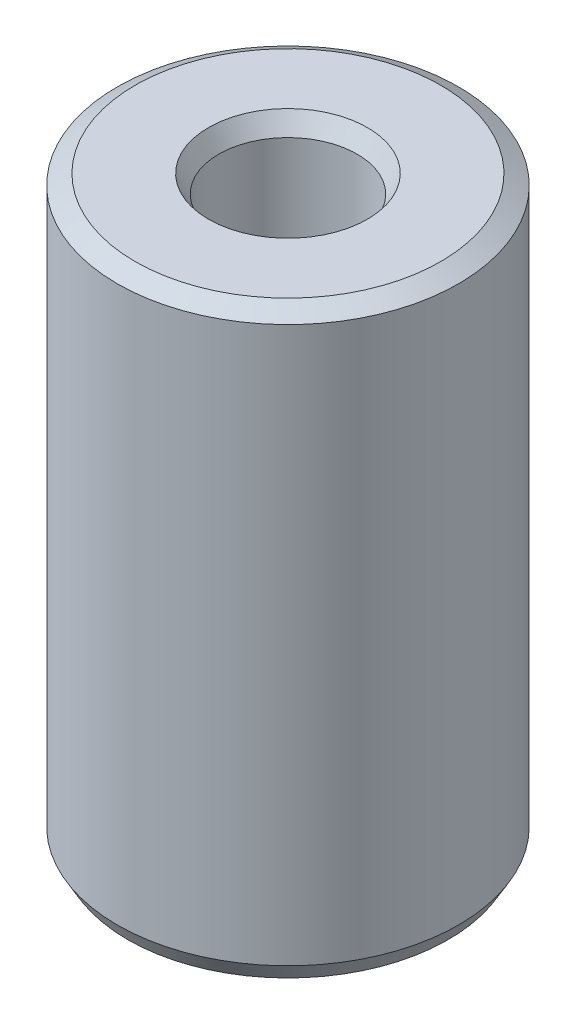
ISO-10303-21;
HEADER;
FILE_DESCRIPTION(('STEP AP214'),'2;1');
FILE_NAME('part.step','',(''),(''),'','','');
FILE_SCHEMA(('AUTOMOTIVE_DESIGN { 1 0 10303 214 1 1 1 1 }'));
ENDSEC;
DATA;
#1=APPLICATION_CONTEXT('core data for automotive mechanical design processes');
#2=APPLICATION_PROTOCOL_DEFINITION('international standard','automotive_design',2000,#1);
#3=PRODUCT_CONTEXT('',#1,'mechanical');
#4=PRODUCT('Part','Part','',(#3));
#5=PRODUCT_RELATED_PRODUCT_CATEGORY('part','',(#4));
#6=PRODUCT_DEFINITION_FORMATION('','',#4);
#7=PRODUCT_DEFINITION_CONTEXT('part definition',#1,'design');
#8=PRODUCT_DEFINITION('design','',#6,#7);
#9=PRODUCT_DEFINITION_SHAPE('','',#8);
#10=(LENGTH_UNIT() NAMED_UNIT(*) SI_UNIT(.MILLI.,.METRE.));
#11=(NAMED_UNIT(*) PLANE_ANGLE_UNIT() SI_UNIT($,.RADIAN.));
#12=(NAMED_UNIT(*) SI_UNIT($,.STERADIAN.) SOLID_ANGLE_UNIT());
#13=UNCERTAINTY_MEASURE_WITH_UNIT(LENGTH_MEASURE(1.E-05),#10,'distance_accuracy_value','');
#14=(GEOMETRIC_REPRESENTATION_CONTEXT(3) GLOBAL_UNCERTAINTY_ASSIGNED_CONTEXT((#13)) GLOBAL_UNIT_ASSIGNED_CONTEXT((#10,
#11,#12)) REPRESENTATION_CONTEXT('',''));
#15=CARTESIAN_POINT('',(0.,0.,0.));
#16=DIRECTION('',(0.,0.,1.));
#17=DIRECTION('',(1.,0.,0.));
#18=AXIS2_PLACEMENT_3D('',#15,#16,#17);
#19=CARTESIAN_POINT('',(0.,94.040246843153,0.));
#20=DIRECTION('',(0.,-1.,0.));
#21=DIRECTION('',(0.,0.,-1.));
#22=AXIS2_PLACEMENT_3D('',#19,#20,#21);
#23=CYLINDRICAL_SURFACE('',#22,27.5);
#24=CARTESIAN_POINT('',(0.,2.87658092964263,0.));
#25=DIRECTION('',(0.,1.,0.));
#26=DIRECTION('',(0.,0.,1.));
#27=AXIS2_PLACEMENT_3D('',#24,#25,#26);
#28=CIRCLE('',#27,27.5);
#29=CARTESIAN_POINT('',(0.,2.87658092964263,27.5));
#30=VERTEX_POINT('',#29);
#31=EDGE_CURVE('E10',#30,#30,#28,.T.);
#32=ORIENTED_EDGE('',*,*,#31,.T.);
#33=EDGE_LOOP('',(#32));
#34=FACE_BOUND('',#33,.T.);
#35=CARTESIAN_POINT('',(0.,92.3794520690781,0.));
#36=DIRECTION('',(0.,1.,0.));
#37=DIRECTION('',(0.,0.,1.));
#38=AXIS2_PLACEMENT_3D('',#35,#36,#37);
#39=CIRCLE('',#38,27.5);
#40=CARTESIAN_POINT('',(0.,92.3794520690781,27.5));
#41=VERTEX_POINT('',#40);
#42=EDGE_CURVE('E50',#41,#41,#39,.F.);
#43=ORIENTED_EDGE('',*,*,#42,.T.);
#44=EDGE_LOOP('',(#43));
#45=FACE_BOUND('',#44,.T.);
#46=ADVANCED_FACE('F39',(#34,#45),#23,.T.);
#47=CARTESIAN_POINT('',(0.,94.040246843153,0.));
#48=DIRECTION('',(0.,1.,0.));
#49=DIRECTION('',(0.,0.,1.));
#50=AXIS2_PLACEMENT_3D('',#47,#48,#49);
#51=PLANE('',#50);
#52=CARTESIAN_POINT('',(0.,94.040246843153,0.));
#53=DIRECTION('',(0.,1.,0.));
#54=DIRECTION('',(0.,0.,1.));
#55=AXIS2_PLACEMENT_3D('',#52,#53,#54);
#56=CIRCLE('',#55,12.8059751251069);
#57=CARTESIAN_POINT('',(0.,94.040246843153,12.8059751251069));
#58=VERTEX_POINT('',#57);
#59=EDGE_CURVE('E58',#58,#58,#56,.F.);
#60=ORIENTED_EDGE('',*,*,#59,.T.);
#61=EDGE_LOOP('',(#60));
#62=FACE_BOUND('',#61,.T.);
#63=CARTESIAN_POINT('',(0.,94.040246843153,0.));
#64=DIRECTION('',(0.,1.,0.));
#65=DIRECTION('',(0.,0.,1.));
#66=AXIS2_PLACEMENT_3D('',#63,#64,#65);
#67=CIRCLE('',#66,24.6234190703574);
#68=CARTESIAN_POINT('',(0.,94.040246843153,24.6234190703574));
#69=VERTEX_POINT('',#68);
#70=EDGE_CURVE('E61',#69,#69,#67,.T.);
#71=ORIENTED_EDGE('',*,*,#70,.T.);
#72=EDGE_LOOP('',(#71));
#73=FACE_BOUND('',#72,.T.);
#74=ADVANCED_FACE('F88',(#62,#73),#51,.T.);
#75=CARTESIAN_POINT('',(0.,0.,0.));
#76=DIRECTION('',(0.,1.,0.));
#77=DIRECTION('',(0.,0.,1.));
#78=AXIS2_PLACEMENT_3D('',#75,#76,#77);
#79=PLANE('',#78);
#80=CARTESIAN_POINT('',(0.,0.,0.));
#81=DIRECTION('',(0.,1.,0.));
#82=DIRECTION('',(0.,0.,1.));
#83=AXIS2_PLACEMENT_3D('',#80,#81,#82);
#84=CIRCLE('',#83,14.0217612806746);
#85=CARTESIAN_POINT('',(0.,0.,14.0217612806746));
#86=VERTEX_POINT('',#85);
#87=EDGE_CURVE('E51',#86,#86,#84,.T.);
#88=ORIENTED_EDGE('',*,*,#87,.T.);
#89=EDGE_LOOP('',(#88));
#90=FACE_BOUND('',#89,.T.);
#91=CARTESIAN_POINT('',(0.,0.,0.));
#92=DIRECTION('',(0.,1.,0.));
#93=DIRECTION('',(0.,0.,1.));
#94=AXIS2_PLACEMENT_3D('',#91,#92,#93);
#95=CIRCLE('',#94,25.8392052259251);
#96=CARTESIAN_POINT('',(0.,0.,25.8392052259251));
#97=VERTEX_POINT('',#96);
#98=EDGE_CURVE('E54',#97,#97,#95,.F.);
#99=ORIENTED_EDGE('',*,*,#98,.T.);
#100=EDGE_LOOP('',(#99));
#101=FACE_BOUND('',#100,.T.);
#102=ADVANCED_FACE('F83',(#90,#101),#79,.F.);
#103=CARTESIAN_POINT('',(0.,94.040246843153,0.));
#104=DIRECTION('',(0.,-1.,0.));
#105=DIRECTION('',(0.,0.,-1.));
#106=AXIS2_PLACEMENT_3D('',#103,#104,#105);
#107=CYLINDRICAL_SURFACE('',#106,11.145180351032);
#108=CARTESIAN_POINT('',(0.,91.1636659135104,0.));
#109=DIRECTION('',(0.,1.,0.));
#110=DIRECTION('',(0.,0.,1.));
#111=AXIS2_PLACEMENT_3D('',#108,#109,#110);
#112=CIRCLE('',#111,11.145180351032);
#113=CARTESIAN_POINT('',(0.,91.1636659135104,11.145180351032));
#114=VERTEX_POINT('',#113);
#115=EDGE_CURVE('E67',#114,#114,#112,.T.);
#116=ORIENTED_EDGE('',*,*,#115,.T.);
#117=EDGE_LOOP('',(#116));
#118=FACE_BOUND('',#117,.T.);
#119=CARTESIAN_POINT('',(0.,1.66079477407491,0.));
#120=DIRECTION('',(0.,1.,0.));
#121=DIRECTION('',(0.,0.,1.));
#122=AXIS2_PLACEMENT_3D('',#119,#120,#121);
#123=CIRCLE('',#122,11.145180351032);
#124=CARTESIAN_POINT('',(0.,1.66079477407491,11.145180351032));
#125=VERTEX_POINT('',#124);
#126=EDGE_CURVE('E69',#125,#125,#123,.F.);
#127=ORIENTED_EDGE('',*,*,#126,.T.);
#128=EDGE_LOOP('',(#127));
#129=FACE_BOUND('',#128,.T.);
#130=ADVANCED_FACE('F71',(#118,#129),#107,.F.);
#131=CARTESIAN_POINT('',(0.,91.1636659135104,0.));
#132=DIRECTION('',(0.,1.,0.));
#133=DIRECTION('',(0.,0.,1.));
#134=AXIS2_PLACEMENT_3D('',#131,#132,#133);
#135=CONICAL_SURFACE('',#134,11.145180351032,0.523598775598297);
#136=ORIENTED_EDGE('',*,*,#59,.F.);
#137=EDGE_LOOP('',(#136));
#138=FACE_BOUND('',#137,.T.);
#139=ORIENTED_EDGE('',*,*,#115,.F.);
#140=EDGE_LOOP('',(#139));
#141=FACE_BOUND('',#140,.T.);
#142=ADVANCED_FACE('F77',(#138,#141),#135,.F.);
#143=CARTESIAN_POINT('',(0.,0.,0.));
#144=DIRECTION('',(0.,-1.,0.));
#145=DIRECTION('',(0.,0.,-1.));
#146=AXIS2_PLACEMENT_3D('',#143,#144,#145);
#147=CONICAL_SURFACE('',#146,14.0217612806746,1.0471975511966);
#148=ORIENTED_EDGE('',*,*,#126,.F.);
#149=EDGE_LOOP('',(#148));
#150=FACE_BOUND('',#149,.T.);
#151=ORIENTED_EDGE('',*,*,#87,.F.);
#152=EDGE_LOOP('',(#151));
#153=FACE_BOUND('',#152,.T.);
#154=ADVANCED_FACE('F73',(#150,#153),#147,.F.);
#155=CARTESIAN_POINT('',(0.,2.87658092964263,0.));
#156=DIRECTION('',(0.,1.,0.));
#157=DIRECTION('',(0.,0.,1.));
#158=AXIS2_PLACEMENT_3D('',#155,#156,#157);
#159=CONICAL_SURFACE('',#158,27.5,0.523598775598301);
#160=ORIENTED_EDGE('',*,*,#98,.F.);
#161=EDGE_LOOP('',(#160));
#162=FACE_BOUND('',#161,.T.);
#163=ORIENTED_EDGE('',*,*,#31,.F.);
#164=EDGE_LOOP('',(#163));
#165=FACE_BOUND('',#164,.T.);
#166=ADVANCED_FACE('F76',(#162,#165),#159,.T.);
#167=CARTESIAN_POINT('',(0.,94.040246843153,0.));
#168=DIRECTION('',(0.,-1.,0.));
#169=DIRECTION('',(0.,0.,-1.));
#170=AXIS2_PLACEMENT_3D('',#167,#168,#169);
#171=CONICAL_SURFACE('',#170,24.6234190703574,1.04719755119659);
#172=ORIENTED_EDGE('',*,*,#42,.F.);
#173=EDGE_LOOP('',(#172));
#174=FACE_BOUND('',#173,.T.);
#175=ORIENTED_EDGE('',*,*,#70,.F.);
#176=EDGE_LOOP('',(#175));
#177=FACE_BOUND('',#176,.T.);
#178=ADVANCED_FACE('F45',(#174,#177),#171,.T.);
#179=CLOSED_SHELL('',(#46,#74,#102,#130,#142,#154,#166,#178));
#180=MANIFOLD_SOLID_BREP('B2',#179);
#181=ADVANCED_BREP_SHAPE_REPRESENTATION('',(#18,#180),#14);
#182=SHAPE_DEFINITION_REPRESENTATION(#9,#181);
ENDSEC;
END-ISO-10303-21;
